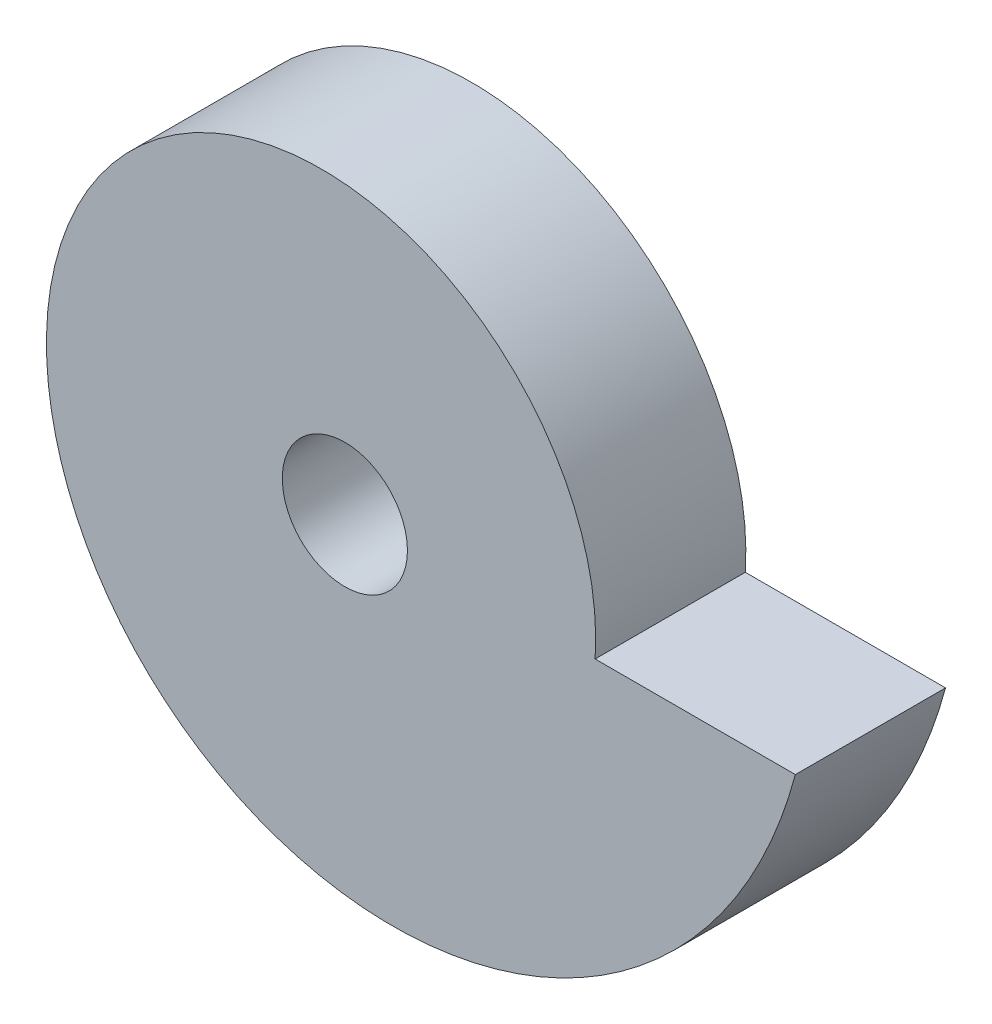
ISO-10303-21;
HEADER;
FILE_DESCRIPTION(('STEP AP214'),'2;1');
FILE_NAME('part.step','',(''),(''),'','','');
FILE_SCHEMA(('AUTOMOTIVE_DESIGN { 1 0 10303 214 1 1 1 1 }'));
ENDSEC;
DATA;
#1=APPLICATION_CONTEXT('core data for automotive mechanical design processes');
#2=APPLICATION_PROTOCOL_DEFINITION('international standard','automotive_design',2000,#1);
#3=PRODUCT_CONTEXT('',#1,'mechanical');
#4=PRODUCT('Part','Part','',(#3));
#5=PRODUCT_RELATED_PRODUCT_CATEGORY('part','',(#4));
#6=PRODUCT_DEFINITION_FORMATION('','',#4);
#7=PRODUCT_DEFINITION_CONTEXT('part definition',#1,'design');
#8=PRODUCT_DEFINITION('design','',#6,#7);
#9=PRODUCT_DEFINITION_SHAPE('','',#8);
#10=(LENGTH_UNIT() NAMED_UNIT(*) SI_UNIT(.MILLI.,.METRE.));
#11=(NAMED_UNIT(*) PLANE_ANGLE_UNIT() SI_UNIT($,.RADIAN.));
#12=(NAMED_UNIT(*) SI_UNIT($,.STERADIAN.) SOLID_ANGLE_UNIT());
#13=UNCERTAINTY_MEASURE_WITH_UNIT(LENGTH_MEASURE(1.E-05),#10,'distance_accuracy_value','');
#14=(GEOMETRIC_REPRESENTATION_CONTEXT(3) GLOBAL_UNCERTAINTY_ASSIGNED_CONTEXT((#13)) GLOBAL_UNIT_ASSIGNED_CONTEXT((#10,
#11,#12)) REPRESENTATION_CONTEXT('',''));
#15=CARTESIAN_POINT('',(0.,0.,0.));
#16=DIRECTION('',(0.,0.,1.));
#17=DIRECTION('',(1.,0.,0.));
#18=AXIS2_PLACEMENT_3D('',#15,#16,#17);
#19=CARTESIAN_POINT('',(-11.9234296266863,-0.176032494394822,3.));
#20=DIRECTION('',(0.,0.,-1.));
#21=DIRECTION('',(-1.,0.,0.));
#22=AXIS2_PLACEMENT_3D('',#19,#20,#21);
#23=PLANE('',#22);
#24=CARTESIAN_POINT('',(10.,0.,3.));
#25=CARTESIAN_POINT('',(10.3923048454132,6.00000000000003,3.));
#26=CARTESIAN_POINT('',(6.9996881277638,12.1238154744237,3.));
#27=CARTESIAN_POINT('',(0.,15.9256239151944,3.));
#28=CARTESIAN_POINT('',(-8.99999999999994,15.5884572681199,3.));
#29=CARTESIAN_POINT('',(-15.5884572681199,9.00000000000004,3.));
#30=CARTESIAN_POINT('',(-18.,0.,3.));
#31=CARTESIAN_POINT('',(-15.5884572681199,-9.00000000000004,3.));
#32=CARTESIAN_POINT('',(-8.99999999999994,-15.5884572681199,3.));
#33=CARTESIAN_POINT('',(0.,-18.,3.));
#34=CARTESIAN_POINT('',(8.99999999999994,-15.5884572681199,3.));
#35=CARTESIAN_POINT('',(15.5884572681199,-9.00000000000004,3.));
#36=CARTESIAN_POINT('',(18.,0.,3.));
#37=B_SPLINE_CURVE_WITH_KNOTS('',12,(#24,#25,#26,#27,#28,#29,#30,#31,#32,#33,#34,#35,#36),
.UNSPECIFIED.,.F.,.F.,(13,13),(0.,1.),.UNSPECIFIED.);
#38=CARTESIAN_POINT('',(10.,0.,3.));
#39=VERTEX_POINT('',#38);
#40=CARTESIAN_POINT('',(18.,0.,3.));
#41=VERTEX_POINT('',#40);
#42=EDGE_CURVE('E67',#39,#41,#37,.T.);
#43=ORIENTED_EDGE('',*,*,#42,.T.);
#44=DIRECTION('',(-1.,0.,0.));
#45=VECTOR('',#44,1.);
#46=CARTESIAN_POINT('',(18.,0.,3.));
#47=LINE('',#46,#45);
#48=EDGE_CURVE('E52',#41,#39,#47,.T.);
#49=ORIENTED_EDGE('',*,*,#48,.T.);
#50=EDGE_LOOP('',(#43,#49));
#51=FACE_BOUND('',#50,.T.);
#52=CARTESIAN_POINT('',(0.,0.,3.));
#53=DIRECTION('',(0.,0.,1.));
#54=DIRECTION('',(1.,0.,0.));
#55=AXIS2_PLACEMENT_3D('',#52,#53,#54);
#56=CIRCLE('',#55,2.5);
#57=CARTESIAN_POINT('',(2.5,0.,3.));
#58=VERTEX_POINT('',#57);
#59=EDGE_CURVE('E73',#58,#58,#56,.T.);
#60=ORIENTED_EDGE('',*,*,#59,.F.);
#61=EDGE_LOOP('',(#60));
#62=FACE_BOUND('',#61,.T.);
#63=ADVANCED_FACE('F35',(#51,#62),#23,.F.);
#64=CARTESIAN_POINT('',(-11.9234296266863,-0.176032494394822,-3.));
#65=DIRECTION('',(0.,0.,-1.));
#66=DIRECTION('',(-1.,0.,0.));
#67=AXIS2_PLACEMENT_3D('',#64,#65,#66);
#68=PLANE('',#67);
#69=CARTESIAN_POINT('',(10.,0.,-3.));
#70=CARTESIAN_POINT('',(10.3923048454132,6.00000000000003,-3.));
#71=CARTESIAN_POINT('',(6.9996881277638,12.1238154744237,-3.));
#72=CARTESIAN_POINT('',(0.,15.9256239151944,-3.));
#73=CARTESIAN_POINT('',(-8.99999999999994,15.5884572681199,-3.));
#74=CARTESIAN_POINT('',(-15.5884572681199,9.00000000000004,-3.));
#75=CARTESIAN_POINT('',(-18.,0.,-3.));
#76=CARTESIAN_POINT('',(-15.5884572681199,-9.00000000000004,-3.));
#77=CARTESIAN_POINT('',(-8.99999999999994,-15.5884572681199,-3.));
#78=CARTESIAN_POINT('',(0.,-18.,-3.));
#79=CARTESIAN_POINT('',(8.99999999999994,-15.5884572681199,-3.));
#80=CARTESIAN_POINT('',(15.5884572681199,-9.00000000000004,-3.));
#81=CARTESIAN_POINT('',(18.,0.,-3.));
#82=B_SPLINE_CURVE_WITH_KNOTS('',12,(#69,#70,#71,#72,#73,#74,#75,#76,#77,#78,#79,#80,#81),
.UNSPECIFIED.,.F.,.F.,(13,13),(0.,1.),.UNSPECIFIED.);
#83=CARTESIAN_POINT('',(10.,0.,-3.));
#84=VERTEX_POINT('',#83);
#85=CARTESIAN_POINT('',(18.,0.,-3.));
#86=VERTEX_POINT('',#85);
#87=EDGE_CURVE('E68',#84,#86,#82,.T.);
#88=ORIENTED_EDGE('',*,*,#87,.F.);
#89=DIRECTION('',(-1.,0.,0.));
#90=VECTOR('',#89,1.);
#91=CARTESIAN_POINT('',(18.,0.,-3.));
#92=LINE('',#91,#90);
#93=EDGE_CURVE('E60',#86,#84,#92,.T.);
#94=ORIENTED_EDGE('',*,*,#93,.F.);
#95=EDGE_LOOP('',(#88,#94));
#96=FACE_BOUND('',#95,.T.);
#97=CARTESIAN_POINT('',(0.,0.,-3.));
#98=DIRECTION('',(0.,0.,1.));
#99=DIRECTION('',(1.,0.,0.));
#100=AXIS2_PLACEMENT_3D('',#97,#98,#99);
#101=CIRCLE('',#100,2.5);
#102=CARTESIAN_POINT('',(2.5,0.,-3.));
#103=VERTEX_POINT('',#102);
#104=EDGE_CURVE('E76',#103,#103,#101,.T.);
#105=ORIENTED_EDGE('',*,*,#104,.T.);
#106=EDGE_LOOP('',(#105));
#107=FACE_BOUND('',#106,.T.);
#108=ADVANCED_FACE('F71',(#96,#107),#68,.T.);
#109=DIRECTION('',(0.,0.,-1.));
#110=VECTOR('',#109,1.);
#111=SURFACE_OF_LINEAR_EXTRUSION('',#37,#110);
#112=ORIENTED_EDGE('',*,*,#87,.T.);
#113=DIRECTION('',(0.,0.,-1.));
#114=VECTOR('',#113,1.);
#115=CARTESIAN_POINT('',(18.,0.,3.));
#116=LINE('',#115,#114);
#117=EDGE_CURVE('E11',#41,#86,#116,.T.);
#118=ORIENTED_EDGE('',*,*,#117,.F.);
#119=ORIENTED_EDGE('',*,*,#42,.F.);
#120=DIRECTION('',(0.,0.,-1.));
#121=VECTOR('',#120,1.);
#122=CARTESIAN_POINT('',(10.,0.,3.));
#123=LINE('',#122,#121);
#124=EDGE_CURVE('E45',#39,#84,#123,.T.);
#125=ORIENTED_EDGE('',*,*,#124,.T.);
#126=EDGE_LOOP('',(#112,#118,#119,#125));
#127=FACE_BOUND('',#126,.T.);
#128=ADVANCED_FACE('F37',(#127),#111,.F.);
#129=CARTESIAN_POINT('',(18.,0.,3.));
#130=DIRECTION('',(0.,-1.,0.));
#131=DIRECTION('',(1.,0.,0.));
#132=AXIS2_PLACEMENT_3D('',#129,#130,#131);
#133=PLANE('',#132);
#134=ORIENTED_EDGE('',*,*,#93,.T.);
#135=ORIENTED_EDGE('',*,*,#124,.F.);
#136=ORIENTED_EDGE('',*,*,#48,.F.);
#137=ORIENTED_EDGE('',*,*,#117,.T.);
#138=EDGE_LOOP('',(#134,#135,#136,#137));
#139=FACE_BOUND('',#138,.T.);
#140=ADVANCED_FACE('F63',(#139),#133,.F.);
#141=CARTESIAN_POINT('',(0.,0.,3.));
#142=DIRECTION('',(0.,0.,-1.));
#143=DIRECTION('',(-1.,0.,0.));
#144=AXIS2_PLACEMENT_3D('',#141,#142,#143);
#145=CYLINDRICAL_SURFACE('',#144,2.5);
#146=ORIENTED_EDGE('',*,*,#59,.T.);
#147=EDGE_LOOP('',(#146));
#148=FACE_BOUND('',#147,.T.);
#149=ORIENTED_EDGE('',*,*,#104,.F.);
#150=EDGE_LOOP('',(#149));
#151=FACE_BOUND('',#150,.T.);
#152=ADVANCED_FACE('F94',(#148,#151),#145,.F.);
#153=CLOSED_SHELL('',(#63,#108,#128,#140,#152));
#154=MANIFOLD_SOLID_BREP('B2',#153);
#155=ADVANCED_BREP_SHAPE_REPRESENTATION('',(#18,#154),#14);
#156=SHAPE_DEFINITION_REPRESENTATION(#9,#155);
ENDSEC;
END-ISO-10303-21;
